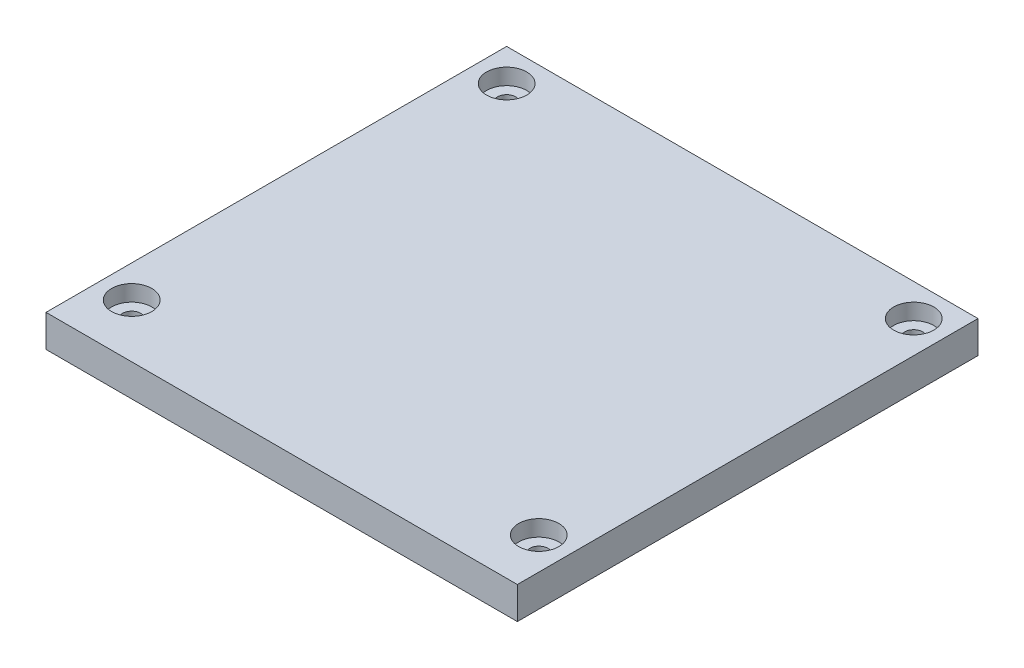
ISO-10303-21;
HEADER;
FILE_DESCRIPTION(('STEP AP214'),'2;1');
FILE_NAME('part.step','',(''),(''),'','','');
FILE_SCHEMA(('AUTOMOTIVE_DESIGN { 1 0 10303 214 1 1 1 1 }'));
ENDSEC;
DATA;
#1=APPLICATION_CONTEXT('core data for automotive mechanical design processes');
#2=APPLICATION_PROTOCOL_DEFINITION('international standard','automotive_design',2000,#1);
#3=PRODUCT_CONTEXT('',#1,'mechanical');
#4=PRODUCT('Part','Part','',(#3));
#5=PRODUCT_RELATED_PRODUCT_CATEGORY('part','',(#4));
#6=PRODUCT_DEFINITION_FORMATION('','',#4);
#7=PRODUCT_DEFINITION_CONTEXT('part definition',#1,'design');
#8=PRODUCT_DEFINITION('design','',#6,#7);
#9=PRODUCT_DEFINITION_SHAPE('','',#8);
#10=(LENGTH_UNIT() NAMED_UNIT(*) SI_UNIT(.MILLI.,.METRE.));
#11=(NAMED_UNIT(*) PLANE_ANGLE_UNIT() SI_UNIT($,.RADIAN.));
#12=(NAMED_UNIT(*) SI_UNIT($,.STERADIAN.) SOLID_ANGLE_UNIT());
#13=UNCERTAINTY_MEASURE_WITH_UNIT(LENGTH_MEASURE(1.E-05),#10,'distance_accuracy_value','');
#14=(GEOMETRIC_REPRESENTATION_CONTEXT(3) GLOBAL_UNCERTAINTY_ASSIGNED_CONTEXT((#13)) GLOBAL_UNIT_ASSIGNED_CONTEXT((#10,
#11,#12)) REPRESENTATION_CONTEXT('',''));
#15=CARTESIAN_POINT('',(0.,0.,0.));
#16=DIRECTION('',(0.,0.,1.));
#17=DIRECTION('',(1.,0.,0.));
#18=AXIS2_PLACEMENT_3D('',#15,#16,#17);
#19=CARTESIAN_POINT('',(0.,3.,0.));
#20=DIRECTION('',(0.,1.,0.));
#21=DIRECTION('',(0.,0.,1.));
#22=AXIS2_PLACEMENT_3D('',#19,#20,#21);
#23=PLANE('',#22);
#24=CARTESIAN_POINT('',(-38.,3.,-35.));
#25=DIRECTION('',(0.,1.,0.));
#26=DIRECTION('',(0.,0.,1.));
#27=AXIS2_PLACEMENT_3D('',#24,#25,#26);
#28=CIRCLE('',#27,1.7);
#29=CARTESIAN_POINT('',(-38.,3.,-33.3));
#30=VERTEX_POINT('',#29);
#31=EDGE_CURVE('E321',#30,#30,#28,.T.);
#32=ORIENTED_EDGE('',*,*,#31,.F.);
#33=EDGE_LOOP('',(#32));
#34=FACE_BOUND('',#33,.T.);
#35=CARTESIAN_POINT('',(-38.,3.,-35.));
#36=DIRECTION('',(0.,1.,0.));
#37=DIRECTION('',(0.,0.,1.));
#38=AXIS2_PLACEMENT_3D('',#35,#36,#37);
#39=CIRCLE('',#38,3.75);
#40=CARTESIAN_POINT('',(-38.,3.,-31.25));
#41=VERTEX_POINT('',#40);
#42=EDGE_CURVE('E11',#41,#41,#39,.F.);
#43=ORIENTED_EDGE('',*,*,#42,.F.);
#44=EDGE_LOOP('',(#43));
#45=FACE_BOUND('',#44,.T.);
#46=ADVANCED_FACE('F39',(#34,#45),#23,.T.);
#47=CARTESIAN_POINT('',(38.,3.,-35.));
#48=DIRECTION('',(0.,1.,0.));
#49=DIRECTION('',(0.,0.,1.));
#50=AXIS2_PLACEMENT_3D('',#47,#48,#49);
#51=CIRCLE('',#50,1.7);
#52=CARTESIAN_POINT('',(38.,3.,-33.3));
#53=VERTEX_POINT('',#52);
#54=EDGE_CURVE('E322',#53,#53,#51,.T.);
#55=ORIENTED_EDGE('',*,*,#54,.F.);
#56=EDGE_LOOP('',(#55));
#57=FACE_BOUND('',#56,.T.);
#58=CARTESIAN_POINT('',(38.,3.,-35.));
#59=DIRECTION('',(0.,1.,0.));
#60=DIRECTION('',(0.,0.,1.));
#61=AXIS2_PLACEMENT_3D('',#58,#59,#60);
#62=CIRCLE('',#61,3.75000000000001);
#63=CARTESIAN_POINT('',(38.,3.,-31.25));
#64=VERTEX_POINT('',#63);
#65=EDGE_CURVE('E47',#64,#64,#62,.F.);
#66=ORIENTED_EDGE('',*,*,#65,.F.);
#67=EDGE_LOOP('',(#66));
#68=FACE_BOUND('',#67,.T.);
#69=ADVANCED_FACE('F368',(#57,#68),#23,.T.);
#70=CARTESIAN_POINT('',(-38.,3.,35.));
#71=DIRECTION('',(0.,1.,0.));
#72=DIRECTION('',(0.,0.,1.));
#73=AXIS2_PLACEMENT_3D('',#70,#71,#72);
#74=CIRCLE('',#73,1.7);
#75=CARTESIAN_POINT('',(-38.,3.,36.7));
#76=VERTEX_POINT('',#75);
#77=EDGE_CURVE('E308',#76,#76,#74,.T.);
#78=ORIENTED_EDGE('',*,*,#77,.F.);
#79=EDGE_LOOP('',(#78));
#80=FACE_BOUND('',#79,.T.);
#81=CARTESIAN_POINT('',(-38.,3.,35.));
#82=DIRECTION('',(0.,1.,0.));
#83=DIRECTION('',(0.,0.,1.));
#84=AXIS2_PLACEMENT_3D('',#81,#82,#83);
#85=CIRCLE('',#84,3.75);
#86=CARTESIAN_POINT('',(-38.,3.,38.75));
#87=VERTEX_POINT('',#86);
#88=EDGE_CURVE('E361',#87,#87,#85,.F.);
#89=ORIENTED_EDGE('',*,*,#88,.F.);
#90=EDGE_LOOP('',(#89));
#91=FACE_BOUND('',#90,.T.);
#92=ADVANCED_FACE('F370',(#80,#91),#23,.T.);
#93=CARTESIAN_POINT('',(38.,3.,35.));
#94=DIRECTION('',(0.,1.,0.));
#95=DIRECTION('',(0.,0.,1.));
#96=AXIS2_PLACEMENT_3D('',#93,#94,#95);
#97=CIRCLE('',#96,1.7);
#98=CARTESIAN_POINT('',(38.,3.,36.7));
#99=VERTEX_POINT('',#98);
#100=EDGE_CURVE('E328',#99,#99,#97,.T.);
#101=ORIENTED_EDGE('',*,*,#100,.F.);
#102=EDGE_LOOP('',(#101));
#103=FACE_BOUND('',#102,.T.);
#104=CARTESIAN_POINT('',(38.,3.,35.));
#105=DIRECTION('',(0.,1.,0.));
#106=DIRECTION('',(0.,0.,1.));
#107=AXIS2_PLACEMENT_3D('',#104,#105,#106);
#108=CIRCLE('',#107,3.75000000000001);
#109=CARTESIAN_POINT('',(38.,3.,38.75));
#110=VERTEX_POINT('',#109);
#111=EDGE_CURVE('E358',#110,#110,#108,.F.);
#112=ORIENTED_EDGE('',*,*,#111,.F.);
#113=EDGE_LOOP('',(#112));
#114=FACE_BOUND('',#113,.T.);
#115=ADVANCED_FACE('F377',(#103,#114),#23,.T.);
#116=CARTESIAN_POINT('',(0.,-2.,0.));
#117=DIRECTION('',(0.,1.,0.));
#118=DIRECTION('',(0.,0.,1.));
#119=AXIS2_PLACEMENT_3D('',#116,#117,#118);
#120=PLANE('',#119);
#121=DIRECTION('',(-1.,0.,0.));
#122=VECTOR('',#121,1.);
#123=CARTESIAN_POINT('',(40.6,-2.,37.6));
#124=LINE('',#123,#122);
#125=CARTESIAN_POINT('',(32.5925976661617,-2.,37.6));
#126=VERTEX_POINT('',#125);
#127=CARTESIAN_POINT('',(-32.5925976661617,-2.,37.6));
#128=VERTEX_POINT('',#127);
#129=EDGE_CURVE('E305',#126,#128,#124,.T.);
#130=ORIENTED_EDGE('',*,*,#129,.T.);
#131=CARTESIAN_POINT('',(-38.,-2.,35.));
#132=DIRECTION('',(0.,1.,0.));
#133=DIRECTION('',(0.,0.,1.));
#134=AXIS2_PLACEMENT_3D('',#131,#132,#133);
#135=CIRCLE('',#134,5.99999999999997);
#136=CARTESIAN_POINT('',(-32.0133481811617,-2.,34.6));
#137=VERTEX_POINT('',#136);
#138=EDGE_CURVE('E213',#128,#137,#135,.T.);
#139=ORIENTED_EDGE('',*,*,#138,.T.);
#140=DIRECTION('',(-1.,0.,0.));
#141=VECTOR('',#140,1.);
#142=CARTESIAN_POINT('',(37.6,-2.,34.6));
#143=LINE('',#142,#141);
#144=CARTESIAN_POINT('',(32.0133481811617,-2.,34.6));
#145=VERTEX_POINT('',#144);
#146=EDGE_CURVE('E281',#145,#137,#143,.T.);
#147=ORIENTED_EDGE('',*,*,#146,.F.);
#148=CARTESIAN_POINT('',(38.,-2.,35.));
#149=DIRECTION('',(0.,1.,0.));
#150=DIRECTION('',(0.,0.,1.));
#151=AXIS2_PLACEMENT_3D('',#148,#149,#150);
#152=CIRCLE('',#151,5.99999999999997);
#153=EDGE_CURVE('E224',#145,#126,#152,.T.);
#154=ORIENTED_EDGE('',*,*,#153,.T.);
#155=EDGE_LOOP('',(#130,#139,#147,#154));
#156=FACE_BOUND('',#155,.T.);
#157=ADVANCED_FACE('F487',(#156),#120,.F.);
#158=DIRECTION('',(0.,0.,1.));
#159=VECTOR('',#158,1.);
#160=CARTESIAN_POINT('',(40.6,-2.,37.6));
#161=LINE('',#160,#159);
#162=CARTESIAN_POINT('',(40.6,-2.,-29.5925976661617));
#163=VERTEX_POINT('',#162);
#164=CARTESIAN_POINT('',(40.6,-2.,29.5925976661618));
#165=VERTEX_POINT('',#164);
#166=EDGE_CURVE('E302',#163,#165,#161,.T.);
#167=ORIENTED_EDGE('',*,*,#166,.T.);
#168=CARTESIAN_POINT('',(37.6,-2.,29.0133481811618));
#169=VERTEX_POINT('',#168);
#170=EDGE_CURVE('E221',#165,#169,#152,.T.);
#171=ORIENTED_EDGE('',*,*,#170,.T.);
#172=DIRECTION('',(0.,0.,1.));
#173=VECTOR('',#172,1.);
#174=CARTESIAN_POINT('',(37.6,-2.,34.6));
#175=LINE('',#174,#173);
#176=CARTESIAN_POINT('',(37.6,-2.,-29.0133481811617));
#177=VERTEX_POINT('',#176);
#178=EDGE_CURVE('E278',#177,#169,#175,.T.);
#179=ORIENTED_EDGE('',*,*,#178,.F.);
#180=CARTESIAN_POINT('',(38.,-2.,-35.));
#181=DIRECTION('',(0.,1.,0.));
#182=DIRECTION('',(0.,0.,1.));
#183=AXIS2_PLACEMENT_3D('',#180,#181,#182);
#184=CIRCLE('',#183,5.99999999999997);
#185=EDGE_CURVE('E228',#177,#163,#184,.T.);
#186=ORIENTED_EDGE('',*,*,#185,.T.);
#187=EDGE_LOOP('',(#167,#171,#179,#186));
#188=FACE_BOUND('',#187,.T.);
#189=ADVANCED_FACE('F520',(#188),#120,.F.);
#190=DIRECTION('',(1.,0.,0.));
#191=VECTOR('',#190,1.);
#192=CARTESIAN_POINT('',(40.6,-2.,-37.6));
#193=LINE('',#192,#191);
#194=CARTESIAN_POINT('',(-32.5925976661617,-2.,-37.6));
#195=VERTEX_POINT('',#194);
#196=CARTESIAN_POINT('',(32.5925976661618,-2.,-37.6));
#197=VERTEX_POINT('',#196);
#198=EDGE_CURVE('E298',#195,#197,#193,.T.);
#199=ORIENTED_EDGE('',*,*,#198,.T.);
#200=CARTESIAN_POINT('',(32.0133481811617,-2.,-34.6));
#201=VERTEX_POINT('',#200);
#202=EDGE_CURVE('E227',#197,#201,#184,.T.);
#203=ORIENTED_EDGE('',*,*,#202,.T.);
#204=DIRECTION('',(1.,0.,0.));
#205=VECTOR('',#204,1.);
#206=CARTESIAN_POINT('',(37.6,-2.,-34.6));
#207=LINE('',#206,#205);
#208=CARTESIAN_POINT('',(-32.0133481811617,-2.,-34.6));
#209=VERTEX_POINT('',#208);
#210=EDGE_CURVE('E275',#209,#201,#207,.T.);
#211=ORIENTED_EDGE('',*,*,#210,.F.);
#212=CARTESIAN_POINT('',(-38.,-2.,-35.));
#213=DIRECTION('',(0.,1.,0.));
#214=DIRECTION('',(0.,0.,1.));
#215=AXIS2_PLACEMENT_3D('',#212,#213,#214);
#216=CIRCLE('',#215,5.99999999999997);
#217=EDGE_CURVE('E260',#209,#195,#216,.T.);
#218=ORIENTED_EDGE('',*,*,#217,.T.);
#219=EDGE_LOOP('',(#199,#203,#211,#218));
#220=FACE_BOUND('',#219,.T.);
#221=ADVANCED_FACE('F397',(#220),#120,.F.);
#222=CARTESIAN_POINT('',(-44.,3.,41.));
#223=DIRECTION('',(1.,0.,0.));
#224=DIRECTION('',(0.,0.,-1.));
#225=AXIS2_PLACEMENT_3D('',#222,#223,#224);
#226=PLANE('',#225);
#227=DIRECTION('',(0.,0.,1.));
#228=VECTOR('',#227,1.);
#229=CARTESIAN_POINT('',(-44.,0.,41.));
#230=LINE('',#229,#228);
#231=CARTESIAN_POINT('',(-44.,0.,-41.));
#232=VERTEX_POINT('',#231);
#233=CARTESIAN_POINT('',(-44.,0.,45.));
#234=VERTEX_POINT('',#233);
#235=EDGE_CURVE('E183',#232,#234,#230,.T.);
#236=ORIENTED_EDGE('',*,*,#235,.T.);
#237=DIRECTION('',(0.,-1.,0.));
#238=VECTOR('',#237,1.);
#239=CARTESIAN_POINT('',(-44.,3.,45.));
#240=LINE('',#239,#238);
#241=CARTESIAN_POINT('',(-44.,6.,45.));
#242=VERTEX_POINT('',#241);
#243=EDGE_CURVE('E178',#242,#234,#240,.T.);
#244=ORIENTED_EDGE('',*,*,#243,.F.);
#245=DIRECTION('',(0.,0.,1.));
#246=VECTOR('',#245,1.);
#247=CARTESIAN_POINT('',(-44.,6.,41.));
#248=LINE('',#247,#246);
#249=CARTESIAN_POINT('',(-44.,6.,-41.));
#250=VERTEX_POINT('',#249);
#251=EDGE_CURVE('E181',#250,#242,#248,.T.);
#252=ORIENTED_EDGE('',*,*,#251,.F.);
#253=DIRECTION('',(0.,-1.,0.));
#254=VECTOR('',#253,1.);
#255=CARTESIAN_POINT('',(-44.,3.,-41.));
#256=LINE('',#255,#254);
#257=EDGE_CURVE('E346',#250,#232,#256,.T.);
#258=ORIENTED_EDGE('',*,*,#257,.T.);
#259=EDGE_LOOP('',(#236,#244,#252,#258));
#260=FACE_BOUND('',#259,.T.);
#261=ADVANCED_FACE('F41',(#260),#226,.F.);
#262=CARTESIAN_POINT('',(44.,3.,41.));
#263=DIRECTION('',(-1.,0.,0.));
#264=DIRECTION('',(0.,0.,1.));
#265=AXIS2_PLACEMENT_3D('',#262,#263,#264);
#266=PLANE('',#265);
#267=DIRECTION('',(0.,0.,-1.));
#268=VECTOR('',#267,1.);
#269=CARTESIAN_POINT('',(44.,0.,41.));
#270=LINE('',#269,#268);
#271=CARTESIAN_POINT('',(44.,0.,45.));
#272=VERTEX_POINT('',#271);
#273=CARTESIAN_POINT('',(44.,0.,-41.));
#274=VERTEX_POINT('',#273);
#275=EDGE_CURVE('E342',#272,#274,#270,.T.);
#276=ORIENTED_EDGE('',*,*,#275,.T.);
#277=DIRECTION('',(0.,-1.,0.));
#278=VECTOR('',#277,1.);
#279=CARTESIAN_POINT('',(44.,3.,-41.));
#280=LINE('',#279,#278);
#281=CARTESIAN_POINT('',(44.,6.,-41.));
#282=VERTEX_POINT('',#281);
#283=EDGE_CURVE('E293',#282,#274,#280,.T.);
#284=ORIENTED_EDGE('',*,*,#283,.F.);
#285=DIRECTION('',(0.,0.,-1.));
#286=VECTOR('',#285,1.);
#287=CARTESIAN_POINT('',(44.,6.,45.));
#288=LINE('',#287,#286);
#289=CARTESIAN_POINT('',(44.,6.,45.));
#290=VERTEX_POINT('',#289);
#291=EDGE_CURVE('E205',#290,#282,#288,.T.);
#292=ORIENTED_EDGE('',*,*,#291,.F.);
#293=DIRECTION('',(0.,1.,0.));
#294=VECTOR('',#293,1.);
#295=CARTESIAN_POINT('',(44.,0.,45.));
#296=LINE('',#295,#294);
#297=EDGE_CURVE('E204',#272,#290,#296,.T.);
#298=ORIENTED_EDGE('',*,*,#297,.F.);
#299=EDGE_LOOP('',(#276,#284,#292,#298));
#300=FACE_BOUND('',#299,.T.);
#301=ADVANCED_FACE('F390',(#300),#266,.F.);
#302=CARTESIAN_POINT('',(44.,3.,-41.));
#303=DIRECTION('',(0.,0.,1.));
#304=DIRECTION('',(1.,0.,0.));
#305=AXIS2_PLACEMENT_3D('',#302,#303,#304);
#306=PLANE('',#305);
#307=DIRECTION('',(-1.,0.,0.));
#308=VECTOR('',#307,1.);
#309=CARTESIAN_POINT('',(44.,0.,-41.));
#310=LINE('',#309,#308);
#311=EDGE_CURVE('E344',#274,#232,#310,.T.);
#312=ORIENTED_EDGE('',*,*,#311,.T.);
#313=ORIENTED_EDGE('',*,*,#257,.F.);
#314=DIRECTION('',(-1.,0.,0.));
#315=VECTOR('',#314,1.);
#316=CARTESIAN_POINT('',(44.,6.,-41.));
#317=LINE('',#316,#315);
#318=EDGE_CURVE('E189',#282,#250,#317,.T.);
#319=ORIENTED_EDGE('',*,*,#318,.F.);
#320=ORIENTED_EDGE('',*,*,#283,.T.);
#321=EDGE_LOOP('',(#312,#313,#319,#320));
#322=FACE_BOUND('',#321,.T.);
#323=ADVANCED_FACE('F388',(#322),#306,.F.);
#324=CARTESIAN_POINT('',(0.,0.,0.));
#325=DIRECTION('',(0.,1.,0.));
#326=DIRECTION('',(0.,0.,1.));
#327=AXIS2_PLACEMENT_3D('',#324,#325,#326);
#328=PLANE('',#327);
#329=CARTESIAN_POINT('',(-38.,0.,35.));
#330=DIRECTION('',(0.,1.,0.));
#331=DIRECTION('',(0.,0.,1.));
#332=AXIS2_PLACEMENT_3D('',#329,#330,#331);
#333=CIRCLE('',#332,5.99999999999997);
#334=CARTESIAN_POINT('',(-32.5925976661617,0.,37.6));
#335=VERTEX_POINT('',#334);
#336=CARTESIAN_POINT('',(-32.0133481811617,0.,34.6));
#337=VERTEX_POINT('',#336);
#338=EDGE_CURVE('E220',#335,#337,#333,.T.);
#339=ORIENTED_EDGE('',*,*,#338,.F.);
#340=DIRECTION('',(-1.,0.,0.));
#341=VECTOR('',#340,1.);
#342=CARTESIAN_POINT('',(40.6,0.,37.6));
#343=LINE('',#342,#341);
#344=CARTESIAN_POINT('',(32.5925976661617,0.,37.6));
#345=VERTEX_POINT('',#344);
#346=EDGE_CURVE('E299',#345,#335,#343,.T.);
#347=ORIENTED_EDGE('',*,*,#346,.F.);
#348=CARTESIAN_POINT('',(38.,0.,35.));
#349=DIRECTION('',(0.,1.,0.));
#350=DIRECTION('',(0.,0.,1.));
#351=AXIS2_PLACEMENT_3D('',#348,#349,#350);
#352=CIRCLE('',#351,5.99999999999997);
#353=CARTESIAN_POINT('',(32.0133481811617,0.,34.6));
#354=VERTEX_POINT('',#353);
#355=EDGE_CURVE('E62',#354,#345,#352,.T.);
#356=ORIENTED_EDGE('',*,*,#355,.F.);
#357=DIRECTION('',(-1.,0.,0.));
#358=VECTOR('',#357,1.);
#359=CARTESIAN_POINT('',(37.6,0.,34.6));
#360=LINE('',#359,#358);
#361=EDGE_CURVE('E287',#354,#337,#360,.T.);
#362=ORIENTED_EDGE('',*,*,#361,.T.);
#363=EDGE_LOOP('',(#339,#347,#356,#362));
#364=FACE_BOUND('',#363,.T.);
#365=CARTESIAN_POINT('',(-37.6,0.,29.0133481811618));
#366=VERTEX_POINT('',#365);
#367=CARTESIAN_POINT('',(-40.6,0.,29.5925976661618));
#368=VERTEX_POINT('',#367);
#369=EDGE_CURVE('E218',#366,#368,#333,.T.);
#370=ORIENTED_EDGE('',*,*,#369,.F.);
#371=DIRECTION('',(0.,0.,-1.));
#372=VECTOR('',#371,1.);
#373=CARTESIAN_POINT('',(-37.6,0.,34.6));
#374=LINE('',#373,#372);
#375=CARTESIAN_POINT('',(-37.6,0.,-29.0133481811617));
#376=VERTEX_POINT('',#375);
#377=EDGE_CURVE('E285',#366,#376,#374,.T.);
#378=ORIENTED_EDGE('',*,*,#377,.T.);
#379=CARTESIAN_POINT('',(-38.,0.,-35.));
#380=DIRECTION('',(0.,1.,0.));
#381=DIRECTION('',(0.,0.,1.));
#382=AXIS2_PLACEMENT_3D('',#379,#380,#381);
#383=CIRCLE('',#382,5.99999999999997);
#384=CARTESIAN_POINT('',(-40.6,0.,-29.5925976661617));
#385=VERTEX_POINT('',#384);
#386=EDGE_CURVE('E256',#385,#376,#383,.T.);
#387=ORIENTED_EDGE('',*,*,#386,.F.);
#388=DIRECTION('',(0.,0.,-1.));
#389=VECTOR('',#388,1.);
#390=CARTESIAN_POINT('',(-40.6,0.,37.6));
#391=LINE('',#390,#389);
#392=EDGE_CURVE('E284',#368,#385,#391,.T.);
#393=ORIENTED_EDGE('',*,*,#392,.F.);
#394=EDGE_LOOP('',(#370,#378,#387,#393));
#395=FACE_BOUND('',#394,.T.);
#396=CARTESIAN_POINT('',(40.6,0.,29.5925976661618));
#397=VERTEX_POINT('',#396);
#398=CARTESIAN_POINT('',(37.6,0.,29.0133481811618));
#399=VERTEX_POINT('',#398);
#400=EDGE_CURVE('E226',#397,#399,#352,.T.);
#401=ORIENTED_EDGE('',*,*,#400,.F.);
#402=DIRECTION('',(0.,0.,1.));
#403=VECTOR('',#402,1.);
#404=CARTESIAN_POINT('',(40.6,0.,37.6));
#405=LINE('',#404,#403);
#406=CARTESIAN_POINT('',(40.6,0.,-29.5925976661617));
#407=VERTEX_POINT('',#406);
#408=EDGE_CURVE('E313',#407,#397,#405,.T.);
#409=ORIENTED_EDGE('',*,*,#408,.F.);
#410=CARTESIAN_POINT('',(38.,0.,-35.));
#411=DIRECTION('',(0.,1.,0.));
#412=DIRECTION('',(0.,0.,1.));
#413=AXIS2_PLACEMENT_3D('',#410,#411,#412);
#414=CIRCLE('',#413,5.99999999999997);
#415=CARTESIAN_POINT('',(37.6,0.,-29.0133481811617));
#416=VERTEX_POINT('',#415);
#417=EDGE_CURVE('E54',#416,#407,#414,.T.);
#418=ORIENTED_EDGE('',*,*,#417,.F.);
#419=DIRECTION('',(0.,0.,1.));
#420=VECTOR('',#419,1.);
#421=CARTESIAN_POINT('',(37.6,0.,34.6));
#422=LINE('',#421,#420);
#423=EDGE_CURVE('E291',#416,#399,#422,.T.);
#424=ORIENTED_EDGE('',*,*,#423,.T.);
#425=EDGE_LOOP('',(#401,#409,#418,#424));
#426=FACE_BOUND('',#425,.T.);
#427=ORIENTED_EDGE('',*,*,#311,.F.);
#428=ORIENTED_EDGE('',*,*,#275,.F.);
#429=DIRECTION('',(1.,0.,0.));
#430=VECTOR('',#429,1.);
#431=CARTESIAN_POINT('',(-44.,0.,45.));
#432=LINE('',#431,#430);
#433=EDGE_CURVE('E188',#234,#272,#432,.T.);
#434=ORIENTED_EDGE('',*,*,#433,.F.);
#435=ORIENTED_EDGE('',*,*,#235,.F.);
#436=EDGE_LOOP('',(#427,#428,#434,#435));
#437=FACE_BOUND('',#436,.T.);
#438=CARTESIAN_POINT('',(32.5925976661618,0.,-37.6));
#439=VERTEX_POINT('',#438);
#440=CARTESIAN_POINT('',(32.0133481811617,0.,-34.6));
#441=VERTEX_POINT('',#440);
#442=EDGE_CURVE('E231',#439,#441,#414,.T.);
#443=ORIENTED_EDGE('',*,*,#442,.F.);
#444=DIRECTION('',(1.,0.,0.));
#445=VECTOR('',#444,1.);
#446=CARTESIAN_POINT('',(40.6,0.,-37.6));
#447=LINE('',#446,#445);
#448=CARTESIAN_POINT('',(-32.5925976661617,0.,-37.6));
#449=VERTEX_POINT('',#448);
#450=EDGE_CURVE('E310',#449,#439,#447,.T.);
#451=ORIENTED_EDGE('',*,*,#450,.F.);
#452=CARTESIAN_POINT('',(-32.0133481811617,0.,-34.6));
#453=VERTEX_POINT('',#452);
#454=EDGE_CURVE('E261',#453,#449,#383,.T.);
#455=ORIENTED_EDGE('',*,*,#454,.F.);
#456=DIRECTION('',(1.,0.,0.));
#457=VECTOR('',#456,1.);
#458=CARTESIAN_POINT('',(37.6,0.,-34.6));
#459=LINE('',#458,#457);
#460=EDGE_CURVE('E288',#453,#441,#459,.T.);
#461=ORIENTED_EDGE('',*,*,#460,.T.);
#462=EDGE_LOOP('',(#443,#451,#455,#461));
#463=FACE_BOUND('',#462,.T.);
#464=CARTESIAN_POINT('',(38.,0.,-35.));
#465=DIRECTION('',(0.,1.,0.));
#466=DIRECTION('',(0.,0.,1.));
#467=AXIS2_PLACEMENT_3D('',#464,#465,#466);
#468=CIRCLE('',#467,1.7);
#469=CARTESIAN_POINT('',(38.,0.,-33.3));
#470=VERTEX_POINT('',#469);
#471=EDGE_CURVE('E318',#470,#470,#468,.T.);
#472=ORIENTED_EDGE('',*,*,#471,.T.);
#473=EDGE_LOOP('',(#472));
#474=FACE_BOUND('',#473,.T.);
#475=CARTESIAN_POINT('',(-38.,0.,-35.));
#476=DIRECTION('',(0.,1.,0.));
#477=DIRECTION('',(0.,0.,1.));
#478=AXIS2_PLACEMENT_3D('',#475,#476,#477);
#479=CIRCLE('',#478,1.7);
#480=CARTESIAN_POINT('',(-38.,0.,-33.3));
#481=VERTEX_POINT('',#480);
#482=EDGE_CURVE('E336',#481,#481,#479,.T.);
#483=ORIENTED_EDGE('',*,*,#482,.T.);
#484=EDGE_LOOP('',(#483));
#485=FACE_BOUND('',#484,.T.);
#486=CARTESIAN_POINT('',(38.,0.,35.));
#487=DIRECTION('',(0.,1.,0.));
#488=DIRECTION('',(0.,0.,1.));
#489=AXIS2_PLACEMENT_3D('',#486,#487,#488);
#490=CIRCLE('',#489,1.7);
#491=CARTESIAN_POINT('',(38.,0.,36.7));
#492=VERTEX_POINT('',#491);
#493=EDGE_CURVE('E325',#492,#492,#490,.T.);
#494=ORIENTED_EDGE('',*,*,#493,.T.);
#495=EDGE_LOOP('',(#494));
#496=FACE_BOUND('',#495,.T.);
#497=CARTESIAN_POINT('',(-38.,0.,35.));
#498=DIRECTION('',(0.,1.,0.));
#499=DIRECTION('',(0.,0.,1.));
#500=AXIS2_PLACEMENT_3D('',#497,#498,#499);
#501=CIRCLE('',#500,1.7);
#502=CARTESIAN_POINT('',(-38.,0.,36.7));
#503=VERTEX_POINT('',#502);
#504=EDGE_CURVE('E331',#503,#503,#501,.T.);
#505=ORIENTED_EDGE('',*,*,#504,.T.);
#506=EDGE_LOOP('',(#505));
#507=FACE_BOUND('',#506,.T.);
#508=ADVANCED_FACE('F385',(#364,#395,#426,#437,#463,#474,#485,#496,#507),#328,.F.);
#509=CARTESIAN_POINT('',(-38.,0.,-35.));
#510=DIRECTION('',(0.,1.,0.));
#511=DIRECTION('',(0.,0.,1.));
#512=AXIS2_PLACEMENT_3D('',#509,#510,#511);
#513=CYLINDRICAL_SURFACE('',#512,1.7);
#514=ORIENTED_EDGE('',*,*,#482,.F.);
#515=EDGE_LOOP('',(#514));
#516=FACE_BOUND('',#515,.T.);
#517=ORIENTED_EDGE('',*,*,#31,.T.);
#518=EDGE_LOOP('',(#517));
#519=FACE_BOUND('',#518,.T.);
#520=ADVANCED_FACE('F383',(#516,#519),#513,.F.);
#521=CARTESIAN_POINT('',(-38.,0.,35.));
#522=DIRECTION('',(0.,1.,0.));
#523=DIRECTION('',(0.,0.,1.));
#524=AXIS2_PLACEMENT_3D('',#521,#522,#523);
#525=CYLINDRICAL_SURFACE('',#524,1.7);
#526=ORIENTED_EDGE('',*,*,#504,.F.);
#527=EDGE_LOOP('',(#526));
#528=FACE_BOUND('',#527,.T.);
#529=ORIENTED_EDGE('',*,*,#77,.T.);
#530=EDGE_LOOP('',(#529));
#531=FACE_BOUND('',#530,.T.);
#532=ADVANCED_FACE('F412',(#528,#531),#525,.F.);
#533=CARTESIAN_POINT('',(38.,0.,35.));
#534=DIRECTION('',(0.,1.,0.));
#535=DIRECTION('',(0.,0.,1.));
#536=AXIS2_PLACEMENT_3D('',#533,#534,#535);
#537=CYLINDRICAL_SURFACE('',#536,1.7);
#538=ORIENTED_EDGE('',*,*,#493,.F.);
#539=EDGE_LOOP('',(#538));
#540=FACE_BOUND('',#539,.T.);
#541=ORIENTED_EDGE('',*,*,#100,.T.);
#542=EDGE_LOOP('',(#541));
#543=FACE_BOUND('',#542,.T.);
#544=ADVANCED_FACE('F415',(#540,#543),#537,.F.);
#545=CARTESIAN_POINT('',(38.,0.,-35.));
#546=DIRECTION('',(0.,1.,0.));
#547=DIRECTION('',(0.,0.,1.));
#548=AXIS2_PLACEMENT_3D('',#545,#546,#547);
#549=CYLINDRICAL_SURFACE('',#548,1.7);
#550=ORIENTED_EDGE('',*,*,#471,.F.);
#551=EDGE_LOOP('',(#550));
#552=FACE_BOUND('',#551,.T.);
#553=ORIENTED_EDGE('',*,*,#54,.T.);
#554=EDGE_LOOP('',(#553));
#555=FACE_BOUND('',#554,.T.);
#556=ADVANCED_FACE('F485',(#552,#555),#549,.F.);
#557=DIRECTION('',(0.,0.,-1.));
#558=VECTOR('',#557,1.);
#559=CARTESIAN_POINT('',(-37.6,-2.,34.6));
#560=LINE('',#559,#558);
#561=CARTESIAN_POINT('',(-37.6,-2.,29.0133481811618));
#562=VERTEX_POINT('',#561);
#563=CARTESIAN_POINT('',(-37.6,-2.,-29.0133481811617));
#564=VERTEX_POINT('',#563);
#565=EDGE_CURVE('E273',#562,#564,#560,.T.);
#566=ORIENTED_EDGE('',*,*,#565,.F.);
#567=CARTESIAN_POINT('',(-40.6,-2.,29.5925976661618));
#568=VERTEX_POINT('',#567);
#569=EDGE_CURVE('E217',#562,#568,#135,.T.);
#570=ORIENTED_EDGE('',*,*,#569,.T.);
#571=DIRECTION('',(0.,0.,-1.));
#572=VECTOR('',#571,1.);
#573=CARTESIAN_POINT('',(-40.6,-2.,37.6));
#574=LINE('',#573,#572);
#575=CARTESIAN_POINT('',(-40.6,-2.,-29.5925976661617));
#576=VERTEX_POINT('',#575);
#577=EDGE_CURVE('E296',#568,#576,#574,.T.);
#578=ORIENTED_EDGE('',*,*,#577,.T.);
#579=EDGE_CURVE('E257',#576,#564,#216,.T.);
#580=ORIENTED_EDGE('',*,*,#579,.T.);
#581=EDGE_LOOP('',(#566,#570,#578,#580));
#582=FACE_BOUND('',#581,.T.);
#583=ADVANCED_FACE('F481',(#582),#120,.F.);
#584=CARTESIAN_POINT('',(-40.6,-2.,37.6));
#585=DIRECTION('',(1.,0.,0.));
#586=DIRECTION('',(0.,0.,-1.));
#587=AXIS2_PLACEMENT_3D('',#584,#585,#586);
#588=PLANE('',#587);
#589=ORIENTED_EDGE('',*,*,#577,.F.);
#590=DIRECTION('',(0.,1.,0.));
#591=VECTOR('',#590,1.);
#592=CARTESIAN_POINT('',(-40.6,-2.,29.5925976661618));
#593=LINE('',#592,#591);
#594=EDGE_CURVE('E245',#568,#368,#593,.T.);
#595=ORIENTED_EDGE('',*,*,#594,.T.);
#596=ORIENTED_EDGE('',*,*,#392,.T.);
#597=DIRECTION('',(0.,1.,0.));
#598=VECTOR('',#597,1.);
#599=CARTESIAN_POINT('',(-40.6,-2.,-29.5925976661617));
#600=LINE('',#599,#598);
#601=EDGE_CURVE('E270',#385,#576,#600,.F.);
#602=ORIENTED_EDGE('',*,*,#601,.T.);
#603=EDGE_LOOP('',(#589,#595,#596,#602));
#604=FACE_BOUND('',#603,.T.);
#605=ADVANCED_FACE('F484',(#604),#588,.F.);
#606=CARTESIAN_POINT('',(40.6,-2.,-37.6));
#607=DIRECTION('',(0.,0.,1.));
#608=DIRECTION('',(1.,0.,0.));
#609=AXIS2_PLACEMENT_3D('',#606,#607,#608);
#610=PLANE('',#609);
#611=ORIENTED_EDGE('',*,*,#450,.T.);
#612=DIRECTION('',(0.,1.,0.));
#613=VECTOR('',#612,1.);
#614=CARTESIAN_POINT('',(32.5925976661618,-2.,-37.6));
#615=LINE('',#614,#613);
#616=EDGE_CURVE('E253',#439,#197,#615,.F.);
#617=ORIENTED_EDGE('',*,*,#616,.T.);
#618=ORIENTED_EDGE('',*,*,#198,.F.);
#619=DIRECTION('',(0.,1.,0.));
#620=VECTOR('',#619,1.);
#621=CARTESIAN_POINT('',(-32.5925976661617,-2.,-37.6));
#622=LINE('',#621,#620);
#623=EDGE_CURVE('E267',#195,#449,#622,.T.);
#624=ORIENTED_EDGE('',*,*,#623,.T.);
#625=EDGE_LOOP('',(#611,#617,#618,#624));
#626=FACE_BOUND('',#625,.T.);
#627=ADVANCED_FACE('F494',(#626),#610,.F.);
#628=CARTESIAN_POINT('',(40.6,-2.,37.6));
#629=DIRECTION('',(-1.,0.,0.));
#630=DIRECTION('',(0.,0.,1.));
#631=AXIS2_PLACEMENT_3D('',#628,#629,#630);
#632=PLANE('',#631);
#633=ORIENTED_EDGE('',*,*,#408,.T.);
#634=DIRECTION('',(0.,1.,0.));
#635=VECTOR('',#634,1.);
#636=CARTESIAN_POINT('',(40.6,-2.,29.5925976661618));
#637=LINE('',#636,#635);
#638=EDGE_CURVE('E237',#397,#165,#637,.F.);
#639=ORIENTED_EDGE('',*,*,#638,.T.);
#640=ORIENTED_EDGE('',*,*,#166,.F.);
#641=DIRECTION('',(0.,1.,0.));
#642=VECTOR('',#641,1.);
#643=CARTESIAN_POINT('',(40.6,-2.,-29.5925976661617));
#644=LINE('',#643,#642);
#645=EDGE_CURVE('E250',#163,#407,#644,.T.);
#646=ORIENTED_EDGE('',*,*,#645,.T.);
#647=EDGE_LOOP('',(#633,#639,#640,#646));
#648=FACE_BOUND('',#647,.T.);
#649=ADVANCED_FACE('F490',(#648),#632,.F.);
#650=CARTESIAN_POINT('',(40.6,-2.,37.6));
#651=DIRECTION('',(0.,0.,-1.));
#652=DIRECTION('',(-1.,0.,0.));
#653=AXIS2_PLACEMENT_3D('',#650,#651,#652);
#654=PLANE('',#653);
#655=ORIENTED_EDGE('',*,*,#346,.T.);
#656=DIRECTION('',(0.,1.,0.));
#657=VECTOR('',#656,1.);
#658=CARTESIAN_POINT('',(-32.5925976661617,-2.,37.6));
#659=LINE('',#658,#657);
#660=EDGE_CURVE('E242',#335,#128,#659,.F.);
#661=ORIENTED_EDGE('',*,*,#660,.T.);
#662=ORIENTED_EDGE('',*,*,#129,.F.);
#663=DIRECTION('',(0.,1.,0.));
#664=VECTOR('',#663,1.);
#665=CARTESIAN_POINT('',(32.5925976661617,-2.,37.6));
#666=LINE('',#665,#664);
#667=EDGE_CURVE('E234',#126,#345,#666,.T.);
#668=ORIENTED_EDGE('',*,*,#667,.T.);
#669=EDGE_LOOP('',(#655,#661,#662,#668));
#670=FACE_BOUND('',#669,.T.);
#671=ADVANCED_FACE('F479',(#670),#654,.F.);
#672=CARTESIAN_POINT('',(-37.6,-2.,34.6));
#673=DIRECTION('',(1.,0.,0.));
#674=DIRECTION('',(0.,0.,-1.));
#675=AXIS2_PLACEMENT_3D('',#672,#673,#674);
#676=PLANE('',#675);
#677=DIRECTION('',(0.,1.,0.));
#678=VECTOR('',#677,1.);
#679=CARTESIAN_POINT('',(-37.6,-2.,29.0133481811618));
#680=LINE('',#679,#678);
#681=EDGE_CURVE('E240',#562,#366,#680,.T.);
#682=ORIENTED_EDGE('',*,*,#681,.F.);
#683=ORIENTED_EDGE('',*,*,#565,.T.);
#684=DIRECTION('',(0.,1.,0.));
#685=VECTOR('',#684,1.);
#686=CARTESIAN_POINT('',(-37.6,-2.,-29.0133481811617));
#687=LINE('',#686,#685);
#688=EDGE_CURVE('E264',#376,#564,#687,.F.);
#689=ORIENTED_EDGE('',*,*,#688,.F.);
#690=ORIENTED_EDGE('',*,*,#377,.F.);
#691=EDGE_LOOP('',(#682,#683,#689,#690));
#692=FACE_BOUND('',#691,.T.);
#693=ADVANCED_FACE('F475',(#692),#676,.T.);
#694=CARTESIAN_POINT('',(37.6,-2.,-34.6));
#695=DIRECTION('',(0.,0.,1.));
#696=DIRECTION('',(1.,0.,0.));
#697=AXIS2_PLACEMENT_3D('',#694,#695,#696);
#698=PLANE('',#697);
#699=DIRECTION('',(0.,1.,0.));
#700=VECTOR('',#699,1.);
#701=CARTESIAN_POINT('',(32.0133481811617,-2.,-34.6));
#702=LINE('',#701,#700);
#703=EDGE_CURVE('E248',#441,#201,#702,.F.);
#704=ORIENTED_EDGE('',*,*,#703,.F.);
#705=ORIENTED_EDGE('',*,*,#460,.F.);
#706=DIRECTION('',(0.,1.,0.));
#707=VECTOR('',#706,1.);
#708=CARTESIAN_POINT('',(-32.0133481811617,-2.,-34.6));
#709=LINE('',#708,#707);
#710=EDGE_CURVE('E295',#209,#453,#709,.T.);
#711=ORIENTED_EDGE('',*,*,#710,.F.);
#712=ORIENTED_EDGE('',*,*,#210,.T.);
#713=EDGE_LOOP('',(#704,#705,#711,#712));
#714=FACE_BOUND('',#713,.T.);
#715=ADVANCED_FACE('F471',(#714),#698,.T.);
#716=CARTESIAN_POINT('',(37.6,-2.,34.6));
#717=DIRECTION('',(-1.,0.,0.));
#718=DIRECTION('',(0.,0.,1.));
#719=AXIS2_PLACEMENT_3D('',#716,#717,#718);
#720=PLANE('',#719);
#721=DIRECTION('',(0.,1.,0.));
#722=VECTOR('',#721,1.);
#723=CARTESIAN_POINT('',(37.6,-2.,29.0133481811618));
#724=LINE('',#723,#722);
#725=EDGE_CURVE('E216',#399,#169,#724,.F.);
#726=ORIENTED_EDGE('',*,*,#725,.F.);
#727=ORIENTED_EDGE('',*,*,#423,.F.);
#728=DIRECTION('',(0.,1.,0.));
#729=VECTOR('',#728,1.);
#730=CARTESIAN_POINT('',(37.6,-2.,-29.0133481811617));
#731=LINE('',#730,#729);
#732=EDGE_CURVE('E356',#177,#416,#731,.T.);
#733=ORIENTED_EDGE('',*,*,#732,.F.);
#734=ORIENTED_EDGE('',*,*,#178,.T.);
#735=EDGE_LOOP('',(#726,#727,#733,#734));
#736=FACE_BOUND('',#735,.T.);
#737=ADVANCED_FACE('F467',(#736),#720,.T.);
#738=CARTESIAN_POINT('',(37.6,-2.,34.6));
#739=DIRECTION('',(0.,0.,-1.));
#740=DIRECTION('',(-1.,0.,0.));
#741=AXIS2_PLACEMENT_3D('',#738,#739,#740);
#742=PLANE('',#741);
#743=DIRECTION('',(0.,1.,0.));
#744=VECTOR('',#743,1.);
#745=CARTESIAN_POINT('',(-32.0133481811617,-2.,34.6));
#746=LINE('',#745,#744);
#747=EDGE_CURVE('E354',#337,#137,#746,.F.);
#748=ORIENTED_EDGE('',*,*,#747,.F.);
#749=ORIENTED_EDGE('',*,*,#361,.F.);
#750=DIRECTION('',(0.,1.,0.));
#751=VECTOR('',#750,1.);
#752=CARTESIAN_POINT('',(32.0133481811617,-2.,34.6));
#753=LINE('',#752,#751);
#754=EDGE_CURVE('E352',#145,#354,#753,.T.);
#755=ORIENTED_EDGE('',*,*,#754,.F.);
#756=ORIENTED_EDGE('',*,*,#146,.T.);
#757=EDGE_LOOP('',(#748,#749,#755,#756));
#758=FACE_BOUND('',#757,.T.);
#759=ADVANCED_FACE('F463',(#758),#742,.T.);
#760=CARTESIAN_POINT('',(-38.,-2.,-35.));
#761=DIRECTION('',(0.,1.,0.));
#762=DIRECTION('',(0.,0.,1.));
#763=AXIS2_PLACEMENT_3D('',#760,#761,#762);
#764=CYLINDRICAL_SURFACE('',#763,5.99999999999997);
#765=ORIENTED_EDGE('',*,*,#386,.T.);
#766=ORIENTED_EDGE('',*,*,#688,.T.);
#767=ORIENTED_EDGE('',*,*,#579,.F.);
#768=ORIENTED_EDGE('',*,*,#601,.F.);
#769=EDGE_LOOP('',(#765,#766,#767,#768));
#770=FACE_BOUND('',#769,.T.);
#771=ADVANCED_FACE('F460',(#770),#764,.F.);
#772=ORIENTED_EDGE('',*,*,#217,.F.);
#773=ORIENTED_EDGE('',*,*,#710,.T.);
#774=ORIENTED_EDGE('',*,*,#454,.T.);
#775=ORIENTED_EDGE('',*,*,#623,.F.);
#776=EDGE_LOOP('',(#772,#773,#774,#775));
#777=FACE_BOUND('',#776,.T.);
#778=ADVANCED_FACE('F454',(#777),#764,.F.);
#779=CARTESIAN_POINT('',(38.,-2.,35.));
#780=DIRECTION('',(0.,1.,0.));
#781=DIRECTION('',(0.,0.,1.));
#782=AXIS2_PLACEMENT_3D('',#779,#780,#781);
#783=CYLINDRICAL_SURFACE('',#782,5.99999999999997);
#784=ORIENTED_EDGE('',*,*,#400,.T.);
#785=ORIENTED_EDGE('',*,*,#725,.T.);
#786=ORIENTED_EDGE('',*,*,#170,.F.);
#787=ORIENTED_EDGE('',*,*,#638,.F.);
#788=EDGE_LOOP('',(#784,#785,#786,#787));
#789=FACE_BOUND('',#788,.T.);
#790=ADVANCED_FACE('F451',(#789),#783,.F.);
#791=ORIENTED_EDGE('',*,*,#153,.F.);
#792=ORIENTED_EDGE('',*,*,#754,.T.);
#793=ORIENTED_EDGE('',*,*,#355,.T.);
#794=ORIENTED_EDGE('',*,*,#667,.F.);
#795=EDGE_LOOP('',(#791,#792,#793,#794));
#796=FACE_BOUND('',#795,.T.);
#797=ADVANCED_FACE('F449',(#796),#783,.F.);
#798=CARTESIAN_POINT('',(-38.,-2.,35.));
#799=DIRECTION('',(0.,1.,0.));
#800=DIRECTION('',(0.,0.,1.));
#801=AXIS2_PLACEMENT_3D('',#798,#799,#800);
#802=CYLINDRICAL_SURFACE('',#801,5.99999999999997);
#803=ORIENTED_EDGE('',*,*,#569,.F.);
#804=ORIENTED_EDGE('',*,*,#681,.T.);
#805=ORIENTED_EDGE('',*,*,#369,.T.);
#806=ORIENTED_EDGE('',*,*,#594,.F.);
#807=EDGE_LOOP('',(#803,#804,#805,#806));
#808=FACE_BOUND('',#807,.T.);
#809=ADVANCED_FACE('F445',(#808),#802,.F.);
#810=ORIENTED_EDGE('',*,*,#338,.T.);
#811=ORIENTED_EDGE('',*,*,#747,.T.);
#812=ORIENTED_EDGE('',*,*,#138,.F.);
#813=ORIENTED_EDGE('',*,*,#660,.F.);
#814=EDGE_LOOP('',(#810,#811,#812,#813));
#815=FACE_BOUND('',#814,.T.);
#816=ADVANCED_FACE('F448',(#815),#802,.F.);
#817=CARTESIAN_POINT('',(38.,-2.,-35.));
#818=DIRECTION('',(0.,1.,0.));
#819=DIRECTION('',(0.,0.,1.));
#820=AXIS2_PLACEMENT_3D('',#817,#818,#819);
#821=CYLINDRICAL_SURFACE('',#820,5.99999999999997);
#822=ORIENTED_EDGE('',*,*,#442,.T.);
#823=ORIENTED_EDGE('',*,*,#703,.T.);
#824=ORIENTED_EDGE('',*,*,#202,.F.);
#825=ORIENTED_EDGE('',*,*,#616,.F.);
#826=EDGE_LOOP('',(#822,#823,#824,#825));
#827=FACE_BOUND('',#826,.T.);
#828=ADVANCED_FACE('F456',(#827),#821,.F.);
#829=ORIENTED_EDGE('',*,*,#185,.F.);
#830=ORIENTED_EDGE('',*,*,#732,.T.);
#831=ORIENTED_EDGE('',*,*,#417,.T.);
#832=ORIENTED_EDGE('',*,*,#645,.F.);
#833=EDGE_LOOP('',(#829,#830,#831,#832));
#834=FACE_BOUND('',#833,.T.);
#835=ADVANCED_FACE('F444',(#834),#821,.F.);
#836=CARTESIAN_POINT('',(0.,0.,45.));
#837=DIRECTION('',(0.,0.,1.));
#838=DIRECTION('',(1.,0.,0.));
#839=AXIS2_PLACEMENT_3D('',#836,#837,#838);
#840=PLANE('',#839);
#841=ORIENTED_EDGE('',*,*,#297,.T.);
#842=DIRECTION('',(1.,0.,0.));
#843=VECTOR('',#842,1.);
#844=CARTESIAN_POINT('',(-44.,6.,45.));
#845=LINE('',#844,#843);
#846=EDGE_CURVE('E197',#242,#290,#845,.T.);
#847=ORIENTED_EDGE('',*,*,#846,.F.);
#848=ORIENTED_EDGE('',*,*,#243,.T.);
#849=ORIENTED_EDGE('',*,*,#433,.T.);
#850=EDGE_LOOP('',(#841,#847,#848,#849));
#851=FACE_BOUND('',#850,.T.);
#852=ADVANCED_FACE('F202',(#851),#840,.T.);
#853=CARTESIAN_POINT('',(0.,6.,0.));
#854=DIRECTION('',(0.,1.,0.));
#855=DIRECTION('',(0.,0.,1.));
#856=AXIS2_PLACEMENT_3D('',#853,#854,#855);
#857=PLANE('',#856);
#858=CARTESIAN_POINT('',(-38.,6.,35.));
#859=DIRECTION('',(0.,1.,0.));
#860=DIRECTION('',(0.,0.,1.));
#861=AXIS2_PLACEMENT_3D('',#858,#859,#860);
#862=CIRCLE('',#861,3.75);
#863=CARTESIAN_POINT('',(-38.,6.,38.75));
#864=VERTEX_POINT('',#863);
#865=EDGE_CURVE('E836',#864,#864,#862,.T.);
#866=ORIENTED_EDGE('',*,*,#865,.F.);
#867=EDGE_LOOP('',(#866));
#868=FACE_BOUND('',#867,.T.);
#869=CARTESIAN_POINT('',(-38.,6.,-35.));
#870=DIRECTION('',(0.,1.,0.));
#871=DIRECTION('',(0.,0.,1.));
#872=AXIS2_PLACEMENT_3D('',#869,#870,#871);
#873=CIRCLE('',#872,3.75);
#874=CARTESIAN_POINT('',(-38.,6.,-31.25));
#875=VERTEX_POINT('',#874);
#876=EDGE_CURVE('E200',#875,#875,#873,.T.);
#877=ORIENTED_EDGE('',*,*,#876,.F.);
#878=EDGE_LOOP('',(#877));
#879=FACE_BOUND('',#878,.T.);
#880=ORIENTED_EDGE('',*,*,#251,.T.);
#881=ORIENTED_EDGE('',*,*,#846,.T.);
#882=ORIENTED_EDGE('',*,*,#291,.T.);
#883=ORIENTED_EDGE('',*,*,#318,.T.);
#884=EDGE_LOOP('',(#880,#881,#882,#883));
#885=FACE_BOUND('',#884,.T.);
#886=CARTESIAN_POINT('',(38.,6.,-35.));
#887=DIRECTION('',(0.,1.,0.));
#888=DIRECTION('',(0.,0.,1.));
#889=AXIS2_PLACEMENT_3D('',#886,#887,#888);
#890=CIRCLE('',#889,3.75000000000001);
#891=CARTESIAN_POINT('',(38.,6.,-31.25));
#892=VERTEX_POINT('',#891);
#893=EDGE_CURVE('E839',#892,#892,#890,.T.);
#894=ORIENTED_EDGE('',*,*,#893,.F.);
#895=EDGE_LOOP('',(#894));
#896=FACE_BOUND('',#895,.T.);
#897=CARTESIAN_POINT('',(38.,6.,35.));
#898=DIRECTION('',(0.,1.,0.));
#899=DIRECTION('',(0.,0.,1.));
#900=AXIS2_PLACEMENT_3D('',#897,#898,#899);
#901=CIRCLE('',#900,3.75000000000001);
#902=CARTESIAN_POINT('',(38.,6.,38.75));
#903=VERTEX_POINT('',#902);
#904=EDGE_CURVE('E844',#903,#903,#901,.T.);
#905=ORIENTED_EDGE('',*,*,#904,.F.);
#906=EDGE_LOOP('',(#905));
#907=FACE_BOUND('',#906,.T.);
#908=ADVANCED_FACE('F194',(#868,#879,#885,#896,#907),#857,.T.);
#909=CARTESIAN_POINT('',(-38.,6.,-35.));
#910=DIRECTION('',(0.,-1.,0.));
#911=DIRECTION('',(0.,0.,-1.));
#912=AXIS2_PLACEMENT_3D('',#909,#910,#911);
#913=CYLINDRICAL_SURFACE('',#912,3.75);
#914=ORIENTED_EDGE('',*,*,#876,.T.);
#915=EDGE_LOOP('',(#914));
#916=FACE_BOUND('',#915,.T.);
#917=ORIENTED_EDGE('',*,*,#42,.T.);
#918=EDGE_LOOP('',(#917));
#919=FACE_BOUND('',#918,.T.);
#920=ADVANCED_FACE('F431',(#916,#919),#913,.F.);
#921=CARTESIAN_POINT('',(38.,6.,-35.));
#922=DIRECTION('',(0.,-1.,0.));
#923=DIRECTION('',(0.,0.,-1.));
#924=AXIS2_PLACEMENT_3D('',#921,#922,#923);
#925=CYLINDRICAL_SURFACE('',#924,3.75000000000001);
#926=ORIENTED_EDGE('',*,*,#893,.T.);
#927=EDGE_LOOP('',(#926));
#928=FACE_BOUND('',#927,.T.);
#929=ORIENTED_EDGE('',*,*,#65,.T.);
#930=EDGE_LOOP('',(#929));
#931=FACE_BOUND('',#930,.T.);
#932=ADVANCED_FACE('F366',(#928,#931),#925,.F.);
#933=CARTESIAN_POINT('',(-38.,6.,35.));
#934=DIRECTION('',(0.,-1.,0.));
#935=DIRECTION('',(0.,0.,-1.));
#936=AXIS2_PLACEMENT_3D('',#933,#934,#935);
#937=CYLINDRICAL_SURFACE('',#936,3.75);
#938=ORIENTED_EDGE('',*,*,#865,.T.);
#939=EDGE_LOOP('',(#938));
#940=FACE_BOUND('',#939,.T.);
#941=ORIENTED_EDGE('',*,*,#88,.T.);
#942=EDGE_LOOP('',(#941));
#943=FACE_BOUND('',#942,.T.);
#944=ADVANCED_FACE('F420',(#940,#943),#937,.F.);
#945=CARTESIAN_POINT('',(38.,6.,35.));
#946=DIRECTION('',(0.,-1.,0.));
#947=DIRECTION('',(0.,0.,-1.));
#948=AXIS2_PLACEMENT_3D('',#945,#946,#947);
#949=CYLINDRICAL_SURFACE('',#948,3.75000000000001);
#950=ORIENTED_EDGE('',*,*,#904,.T.);
#951=EDGE_LOOP('',(#950));
#952=FACE_BOUND('',#951,.T.);
#953=ORIENTED_EDGE('',*,*,#111,.T.);
#954=EDGE_LOOP('',(#953));
#955=FACE_BOUND('',#954,.T.);
#956=ADVANCED_FACE('F422',(#952,#955),#949,.F.);
#957=CLOSED_SHELL('',(#46,#69,#92,#115,#157,#189,#221,#261,#301,#323,#508,#520,#532,#544,#556,
#583,#605,#627,#649,#671,#693,#715,#737,#759,#771,#778,#790,#797,#809,#816,#828,#835,#852,#908,
#920,#932,#944,#956));
#958=MANIFOLD_SOLID_BREP('B2',#957);
#959=ADVANCED_BREP_SHAPE_REPRESENTATION('',(#18,#958),#14);
#960=SHAPE_DEFINITION_REPRESENTATION(#9,#959);
ENDSEC;
END-ISO-10303-21;
